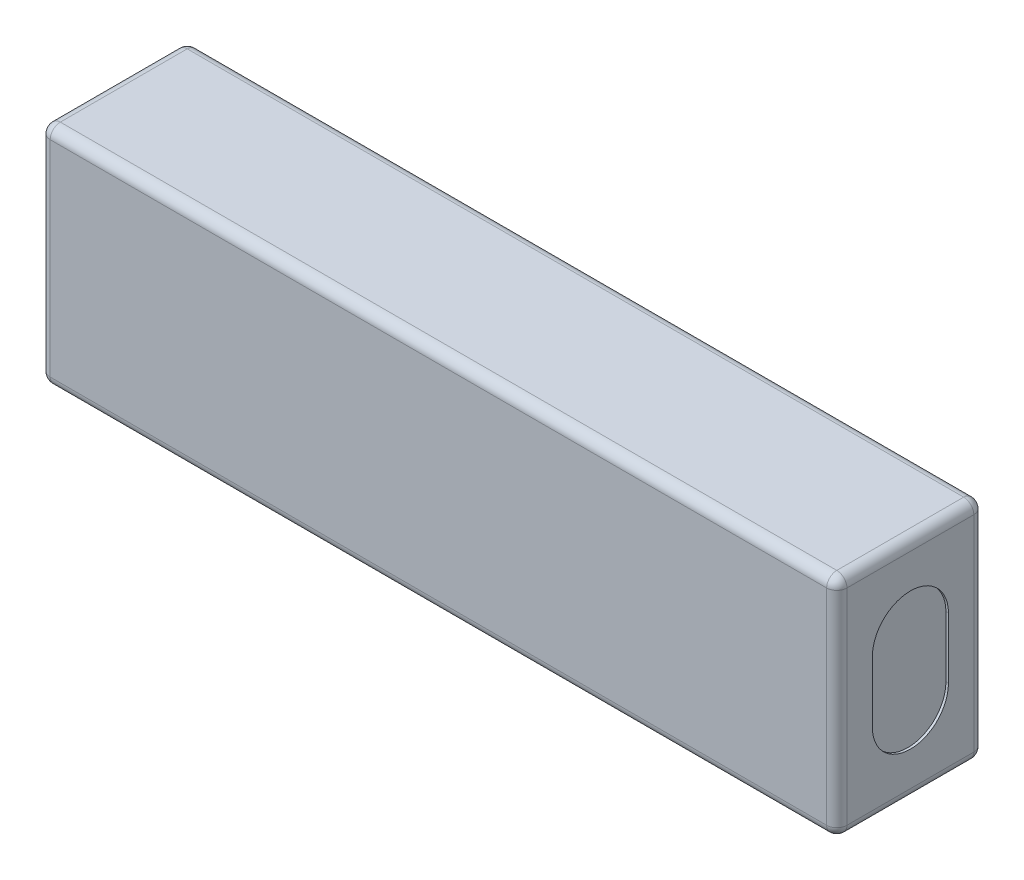
ISO-10303-21;
HEADER;
FILE_DESCRIPTION(('STEP AP214'),'2;1');
FILE_NAME('part.step','',(''),(''),'','','');
FILE_SCHEMA(('AUTOMOTIVE_DESIGN { 1 0 10303 214 1 1 1 1 }'));
ENDSEC;
DATA;
#1=APPLICATION_CONTEXT('core data for automotive mechanical design processes');
#2=APPLICATION_PROTOCOL_DEFINITION('international standard','automotive_design',2000,#1);
#3=PRODUCT_CONTEXT('',#1,'mechanical');
#4=PRODUCT('Part','Part','',(#3));
#5=PRODUCT_RELATED_PRODUCT_CATEGORY('part','',(#4));
#6=PRODUCT_DEFINITION_FORMATION('','',#4);
#7=PRODUCT_DEFINITION_CONTEXT('part definition',#1,'design');
#8=PRODUCT_DEFINITION('design','',#6,#7);
#9=PRODUCT_DEFINITION_SHAPE('','',#8);
#10=(LENGTH_UNIT() NAMED_UNIT(*) SI_UNIT(.MILLI.,.METRE.));
#11=(NAMED_UNIT(*) PLANE_ANGLE_UNIT() SI_UNIT($,.RADIAN.));
#12=(NAMED_UNIT(*) SI_UNIT($,.STERADIAN.) SOLID_ANGLE_UNIT());
#13=UNCERTAINTY_MEASURE_WITH_UNIT(LENGTH_MEASURE(1.E-05),#10,'distance_accuracy_value','');
#14=(GEOMETRIC_REPRESENTATION_CONTEXT(3) GLOBAL_UNCERTAINTY_ASSIGNED_CONTEXT((#13)) GLOBAL_UNIT_ASSIGNED_CONTEXT((#10,
#11,#12)) REPRESENTATION_CONTEXT('',''));
#15=CARTESIAN_POINT('',(0.,0.,0.));
#16=DIRECTION('',(0.,0.,1.));
#17=DIRECTION('',(1.,0.,0.));
#18=AXIS2_PLACEMENT_3D('',#15,#16,#17);
#19=CARTESIAN_POINT('',(-78.5,22.25,14.5));
#20=DIRECTION('',(1.,0.,0.));
#21=DIRECTION('',(0.,1.,0.));
#22=AXIS2_PLACEMENT_3D('',#19,#20,#21);
#23=PLANE('',#22);
#24=DIRECTION('',(0.,-1.,0.));
#25=VECTOR('',#24,1.);
#26=CARTESIAN_POINT('',(-78.5,22.25,-12.5));
#27=LINE('',#26,#25);
#28=CARTESIAN_POINT('',(-78.5,20.25,-12.5));
#29=VERTEX_POINT('',#28);
#30=CARTESIAN_POINT('',(-78.5,-20.25,-12.5));
#31=VERTEX_POINT('',#30);
#32=EDGE_CURVE('E260',#29,#31,#27,.T.);
#33=ORIENTED_EDGE('',*,*,#32,.T.);
#34=DIRECTION('',(0.,0.,-1.));
#35=VECTOR('',#34,1.);
#36=CARTESIAN_POINT('',(-78.5,-20.25,14.5));
#37=LINE('',#36,#35);
#38=CARTESIAN_POINT('',(-78.5,-20.25,12.5));
#39=VERTEX_POINT('',#38);
#40=EDGE_CURVE('E262',#31,#39,#37,.F.);
#41=ORIENTED_EDGE('',*,*,#40,.T.);
#42=DIRECTION('',(0.,-1.,0.));
#43=VECTOR('',#42,1.);
#44=CARTESIAN_POINT('',(-78.5,22.25,12.5));
#45=LINE('',#44,#43);
#46=CARTESIAN_POINT('',(-78.5,20.25,12.5));
#47=VERTEX_POINT('',#46);
#48=EDGE_CURVE('E256',#39,#47,#45,.F.);
#49=ORIENTED_EDGE('',*,*,#48,.T.);
#50=DIRECTION('',(0.,0.,-1.));
#51=VECTOR('',#50,1.);
#52=CARTESIAN_POINT('',(-78.5,20.25,14.5));
#53=LINE('',#52,#51);
#54=EDGE_CURVE('E258',#47,#29,#53,.T.);
#55=ORIENTED_EDGE('',*,*,#54,.T.);
#56=EDGE_LOOP('',(#33,#41,#49,#55));
#57=FACE_BOUND('',#56,.T.);
#58=CARTESIAN_POINT('',(-78.5,6.00000000000004,0.));
#59=DIRECTION('',(1.,0.,0.));
#60=DIRECTION('',(0.,1.,0.));
#61=AXIS2_PLACEMENT_3D('',#58,#59,#60);
#62=CIRCLE('',#61,7.5);
#63=CARTESIAN_POINT('',(-78.5,6.00000000000004,-7.5));
#64=VERTEX_POINT('',#63);
#65=CARTESIAN_POINT('',(-78.5,6.00000000000004,7.5));
#66=VERTEX_POINT('',#65);
#67=EDGE_CURVE('E193',#64,#66,#62,.T.);
#68=ORIENTED_EDGE('',*,*,#67,.T.);
#69=DIRECTION('',(0.,-1.,0.));
#70=VECTOR('',#69,1.);
#71=CARTESIAN_POINT('',(-78.5,6.00000000000004,7.5));
#72=LINE('',#71,#70);
#73=CARTESIAN_POINT('',(-78.5,-5.99999999999996,7.49999999999999));
#74=VERTEX_POINT('',#73);
#75=EDGE_CURVE('E197',#66,#74,#72,.T.);
#76=ORIENTED_EDGE('',*,*,#75,.T.);
#77=CARTESIAN_POINT('',(-78.5,-5.99999999999996,0.));
#78=DIRECTION('',(1.,0.,0.));
#79=DIRECTION('',(0.,1.,0.));
#80=AXIS2_PLACEMENT_3D('',#77,#78,#79);
#81=CIRCLE('',#80,7.5);
#82=CARTESIAN_POINT('',(-78.5,-5.99999999999996,-7.5));
#83=VERTEX_POINT('',#82);
#84=EDGE_CURVE('E200',#74,#83,#81,.T.);
#85=ORIENTED_EDGE('',*,*,#84,.T.);
#86=DIRECTION('',(0.,1.,0.));
#87=VECTOR('',#86,1.);
#88=CARTESIAN_POINT('',(-78.5,6.00000000000004,-7.5));
#89=LINE('',#88,#87);
#90=EDGE_CURVE('E206',#83,#64,#89,.T.);
#91=ORIENTED_EDGE('',*,*,#90,.T.);
#92=EDGE_LOOP('',(#68,#76,#85,#91));
#93=FACE_BOUND('',#92,.T.);
#94=ADVANCED_FACE('F36',(#57,#93),#23,.F.);
#95=CARTESIAN_POINT('',(78.5,22.25,14.5));
#96=DIRECTION('',(-1.,0.,0.));
#97=DIRECTION('',(0.,-1.,0.));
#98=AXIS2_PLACEMENT_3D('',#95,#96,#97);
#99=PLANE('',#98);
#100=DIRECTION('',(0.,1.,0.));
#101=VECTOR('',#100,1.);
#102=CARTESIAN_POINT('',(78.5,-22.25,12.5));
#103=LINE('',#102,#101);
#104=CARTESIAN_POINT('',(78.5,20.25,12.5));
#105=VERTEX_POINT('',#104);
#106=CARTESIAN_POINT('',(78.5,-20.25,12.5));
#107=VERTEX_POINT('',#106);
#108=EDGE_CURVE('E265',#105,#107,#103,.F.);
#109=ORIENTED_EDGE('',*,*,#108,.T.);
#110=DIRECTION('',(0.,0.,-1.));
#111=VECTOR('',#110,1.);
#112=CARTESIAN_POINT('',(78.5,-20.25,14.5));
#113=LINE('',#112,#111);
#114=CARTESIAN_POINT('',(78.5,-20.25,-12.5));
#115=VERTEX_POINT('',#114);
#116=EDGE_CURVE('E271',#107,#115,#113,.T.);
#117=ORIENTED_EDGE('',*,*,#116,.T.);
#118=DIRECTION('',(0.,1.,0.));
#119=VECTOR('',#118,1.);
#120=CARTESIAN_POINT('',(78.5,22.25,-12.5));
#121=LINE('',#120,#119);
#122=CARTESIAN_POINT('',(78.5,20.25,-12.5));
#123=VERTEX_POINT('',#122);
#124=EDGE_CURVE('E269',#115,#123,#121,.T.);
#125=ORIENTED_EDGE('',*,*,#124,.T.);
#126=DIRECTION('',(0.,0.,-1.));
#127=VECTOR('',#126,1.);
#128=CARTESIAN_POINT('',(78.5,20.25,14.5));
#129=LINE('',#128,#127);
#130=EDGE_CURVE('E267',#123,#105,#129,.F.);
#131=ORIENTED_EDGE('',*,*,#130,.T.);
#132=EDGE_LOOP('',(#109,#117,#125,#131));
#133=FACE_BOUND('',#132,.T.);
#134=DIRECTION('',(0.,-1.,0.));
#135=VECTOR('',#134,1.);
#136=CARTESIAN_POINT('',(78.5,6.00000000000004,7.5));
#137=LINE('',#136,#135);
#138=CARTESIAN_POINT('',(78.5,6.00000000000004,7.5));
#139=VERTEX_POINT('',#138);
#140=CARTESIAN_POINT('',(78.5,-5.99999999999996,7.49999999999999));
#141=VERTEX_POINT('',#140);
#142=EDGE_CURVE('E231',#139,#141,#137,.T.);
#143=ORIENTED_EDGE('',*,*,#142,.F.);
#144=CARTESIAN_POINT('',(78.5,6.00000000000004,0.));
#145=DIRECTION('',(1.,0.,0.));
#146=DIRECTION('',(0.,1.,0.));
#147=AXIS2_PLACEMENT_3D('',#144,#145,#146);
#148=CIRCLE('',#147,7.5);
#149=CARTESIAN_POINT('',(78.5,6.00000000000004,-7.5));
#150=VERTEX_POINT('',#149);
#151=EDGE_CURVE('E212',#150,#139,#148,.T.);
#152=ORIENTED_EDGE('',*,*,#151,.F.);
#153=DIRECTION('',(0.,1.,0.));
#154=VECTOR('',#153,1.);
#155=CARTESIAN_POINT('',(78.5,6.00000000000004,-7.5));
#156=LINE('',#155,#154);
#157=CARTESIAN_POINT('',(78.5,-5.99999999999996,-7.5));
#158=VERTEX_POINT('',#157);
#159=EDGE_CURVE('E220',#158,#150,#156,.T.);
#160=ORIENTED_EDGE('',*,*,#159,.F.);
#161=CARTESIAN_POINT('',(78.5,-5.99999999999996,0.));
#162=DIRECTION('',(1.,0.,0.));
#163=DIRECTION('',(0.,1.,0.));
#164=AXIS2_PLACEMENT_3D('',#161,#162,#163);
#165=CIRCLE('',#164,7.5);
#166=EDGE_CURVE('E234',#141,#158,#165,.T.);
#167=ORIENTED_EDGE('',*,*,#166,.F.);
#168=EDGE_LOOP('',(#143,#152,#160,#167));
#169=FACE_BOUND('',#168,.T.);
#170=ADVANCED_FACE('F399',(#133,#169),#99,.F.);
#171=CARTESIAN_POINT('',(-78.5,22.25,14.5));
#172=DIRECTION('',(0.,-1.,0.));
#173=DIRECTION('',(0.,0.,-1.));
#174=AXIS2_PLACEMENT_3D('',#171,#172,#173);
#175=PLANE('',#174);
#176=DIRECTION('',(0.,0.,-1.));
#177=VECTOR('',#176,1.);
#178=CARTESIAN_POINT('',(76.5,22.25,14.5));
#179=LINE('',#178,#177);
#180=CARTESIAN_POINT('',(76.5,22.25,12.5));
#181=VERTEX_POINT('',#180);
#182=CARTESIAN_POINT('',(76.5,22.25,-12.5));
#183=VERTEX_POINT('',#182);
#184=EDGE_CURVE('E287',#181,#183,#179,.T.);
#185=ORIENTED_EDGE('',*,*,#184,.T.);
#186=DIRECTION('',(-1.,0.,0.));
#187=VECTOR('',#186,1.);
#188=CARTESIAN_POINT('',(-78.5,22.25,-12.5));
#189=LINE('',#188,#187);
#190=CARTESIAN_POINT('',(-76.5,22.25,-12.5));
#191=VERTEX_POINT('',#190);
#192=EDGE_CURVE('E290',#183,#191,#189,.T.);
#193=ORIENTED_EDGE('',*,*,#192,.T.);
#194=DIRECTION('',(0.,0.,-1.));
#195=VECTOR('',#194,1.);
#196=CARTESIAN_POINT('',(-76.5,22.25,14.5));
#197=LINE('',#196,#195);
#198=CARTESIAN_POINT('',(-76.5,22.25,12.5));
#199=VERTEX_POINT('',#198);
#200=EDGE_CURVE('E285',#191,#199,#197,.F.);
#201=ORIENTED_EDGE('',*,*,#200,.T.);
#202=DIRECTION('',(-1.,0.,0.));
#203=VECTOR('',#202,1.);
#204=CARTESIAN_POINT('',(78.5,22.25,12.5));
#205=LINE('',#204,#203);
#206=EDGE_CURVE('E283',#199,#181,#205,.F.);
#207=ORIENTED_EDGE('',*,*,#206,.T.);
#208=EDGE_LOOP('',(#185,#193,#201,#207));
#209=FACE_BOUND('',#208,.T.);
#210=ADVANCED_FACE('F414',(#209),#175,.F.);
#211=CARTESIAN_POINT('',(-78.5,-22.25,14.5));
#212=DIRECTION('',(0.,1.,0.));
#213=DIRECTION('',(0.,0.,1.));
#214=AXIS2_PLACEMENT_3D('',#211,#212,#213);
#215=PLANE('',#214);
#216=DIRECTION('',(0.,0.,-1.));
#217=VECTOR('',#216,1.);
#218=CARTESIAN_POINT('',(-76.5,-22.25,14.5));
#219=LINE('',#218,#217);
#220=CARTESIAN_POINT('',(-76.5,-22.25,12.5));
#221=VERTEX_POINT('',#220);
#222=CARTESIAN_POINT('',(-76.5,-22.25,-12.5));
#223=VERTEX_POINT('',#222);
#224=EDGE_CURVE('E251',#221,#223,#219,.T.);
#225=ORIENTED_EDGE('',*,*,#224,.T.);
#226=DIRECTION('',(1.,0.,0.));
#227=VECTOR('',#226,1.);
#228=CARTESIAN_POINT('',(-78.5,-22.25,-12.5));
#229=LINE('',#228,#227);
#230=CARTESIAN_POINT('',(76.5,-22.25,-12.5));
#231=VERTEX_POINT('',#230);
#232=EDGE_CURVE('E254',#223,#231,#229,.T.);
#233=ORIENTED_EDGE('',*,*,#232,.T.);
#234=DIRECTION('',(0.,0.,-1.));
#235=VECTOR('',#234,1.);
#236=CARTESIAN_POINT('',(76.5,-22.25,14.5));
#237=LINE('',#236,#235);
#238=CARTESIAN_POINT('',(76.5,-22.25,12.5));
#239=VERTEX_POINT('',#238);
#240=EDGE_CURVE('E249',#231,#239,#237,.F.);
#241=ORIENTED_EDGE('',*,*,#240,.T.);
#242=DIRECTION('',(1.,0.,0.));
#243=VECTOR('',#242,1.);
#244=CARTESIAN_POINT('',(-78.5,-22.25,12.5));
#245=LINE('',#244,#243);
#246=EDGE_CURVE('E241',#239,#221,#245,.F.);
#247=ORIENTED_EDGE('',*,*,#246,.T.);
#248=EDGE_LOOP('',(#225,#233,#241,#247));
#249=FACE_BOUND('',#248,.T.);
#250=ADVANCED_FACE('F446',(#249),#215,.F.);
#251=CARTESIAN_POINT('',(0.,0.,14.5));
#252=DIRECTION('',(0.,0.,1.));
#253=DIRECTION('',(1.,0.,0.));
#254=AXIS2_PLACEMENT_3D('',#251,#252,#253);
#255=PLANE('',#254);
#256=DIRECTION('',(0.,-1.,0.));
#257=VECTOR('',#256,1.);
#258=CARTESIAN_POINT('',(-76.5,-22.25,14.5));
#259=LINE('',#258,#257);
#260=CARTESIAN_POINT('',(-76.5,20.25,14.5));
#261=VERTEX_POINT('',#260);
#262=CARTESIAN_POINT('',(-76.5,-20.25,14.5));
#263=VERTEX_POINT('',#262);
#264=EDGE_CURVE('E45',#261,#263,#259,.T.);
#265=ORIENTED_EDGE('',*,*,#264,.T.);
#266=DIRECTION('',(1.,0.,0.));
#267=VECTOR('',#266,1.);
#268=CARTESIAN_POINT('',(78.5,-20.25,14.5));
#269=LINE('',#268,#267);
#270=CARTESIAN_POINT('',(76.5,-20.25,14.5));
#271=VERTEX_POINT('',#270);
#272=EDGE_CURVE('E11',#263,#271,#269,.T.);
#273=ORIENTED_EDGE('',*,*,#272,.T.);
#274=DIRECTION('',(0.,1.,0.));
#275=VECTOR('',#274,1.);
#276=CARTESIAN_POINT('',(76.5,22.25,14.5));
#277=LINE('',#276,#275);
#278=CARTESIAN_POINT('',(76.5,20.25,14.5));
#279=VERTEX_POINT('',#278);
#280=EDGE_CURVE('E292',#271,#279,#277,.T.);
#281=ORIENTED_EDGE('',*,*,#280,.T.);
#282=DIRECTION('',(-1.,0.,0.));
#283=VECTOR('',#282,1.);
#284=CARTESIAN_POINT('',(-78.5,20.25,14.5));
#285=LINE('',#284,#283);
#286=EDGE_CURVE('E56',#279,#261,#285,.T.);
#287=ORIENTED_EDGE('',*,*,#286,.T.);
#288=EDGE_LOOP('',(#265,#273,#281,#287));
#289=FACE_BOUND('',#288,.T.);
#290=ADVANCED_FACE('F392',(#289),#255,.T.);
#291=CARTESIAN_POINT('',(0.,0.,-14.5));
#292=DIRECTION('',(0.,0.,1.));
#293=DIRECTION('',(1.,0.,0.));
#294=AXIS2_PLACEMENT_3D('',#291,#292,#293);
#295=PLANE('',#294);
#296=DIRECTION('',(1.,0.,0.));
#297=VECTOR('',#296,1.);
#298=CARTESIAN_POINT('',(0.,-20.25,-14.5));
#299=LINE('',#298,#297);
#300=CARTESIAN_POINT('',(76.5,-20.25,-14.5));
#301=VERTEX_POINT('',#300);
#302=CARTESIAN_POINT('',(-76.5,-20.25,-14.5));
#303=VERTEX_POINT('',#302);
#304=EDGE_CURVE('E278',#301,#303,#299,.F.);
#305=ORIENTED_EDGE('',*,*,#304,.T.);
#306=DIRECTION('',(0.,-1.,0.));
#307=VECTOR('',#306,1.);
#308=CARTESIAN_POINT('',(-76.5,0.,-14.5));
#309=LINE('',#308,#307);
#310=CARTESIAN_POINT('',(-76.5,20.25,-14.5));
#311=VERTEX_POINT('',#310);
#312=EDGE_CURVE('E280',#303,#311,#309,.F.);
#313=ORIENTED_EDGE('',*,*,#312,.T.);
#314=DIRECTION('',(-1.,0.,0.));
#315=VECTOR('',#314,1.);
#316=CARTESIAN_POINT('',(0.,20.25,-14.5));
#317=LINE('',#316,#315);
#318=CARTESIAN_POINT('',(76.5,20.25,-14.5));
#319=VERTEX_POINT('',#318);
#320=EDGE_CURVE('E274',#311,#319,#317,.F.);
#321=ORIENTED_EDGE('',*,*,#320,.T.);
#322=DIRECTION('',(0.,1.,0.));
#323=VECTOR('',#322,1.);
#324=CARTESIAN_POINT('',(76.5,0.,-14.5));
#325=LINE('',#324,#323);
#326=EDGE_CURVE('E276',#319,#301,#325,.F.);
#327=ORIENTED_EDGE('',*,*,#326,.T.);
#328=EDGE_LOOP('',(#305,#313,#321,#327));
#329=FACE_BOUND('',#328,.T.);
#330=ADVANCED_FACE('F453',(#329),#295,.F.);
#331=CARTESIAN_POINT('',(78.,6.00000000000004,0.));
#332=DIRECTION('',(1.,0.,0.));
#333=DIRECTION('',(0.,1.,0.));
#334=AXIS2_PLACEMENT_3D('',#331,#332,#333);
#335=CYLINDRICAL_SURFACE('',#334,7.5);
#336=ORIENTED_EDGE('',*,*,#151,.T.);
#337=DIRECTION('',(1.,0.,0.));
#338=VECTOR('',#337,1.);
#339=CARTESIAN_POINT('',(78.,6.00000000000004,7.5));
#340=LINE('',#339,#338);
#341=CARTESIAN_POINT('',(78.,6.00000000000004,7.5));
#342=VERTEX_POINT('',#341);
#343=EDGE_CURVE('E229',#342,#139,#340,.T.);
#344=ORIENTED_EDGE('',*,*,#343,.F.);
#345=CARTESIAN_POINT('',(78.,6.00000000000004,0.));
#346=DIRECTION('',(1.,0.,0.));
#347=DIRECTION('',(0.,1.,0.));
#348=AXIS2_PLACEMENT_3D('',#345,#346,#347);
#349=CIRCLE('',#348,7.5);
#350=CARTESIAN_POINT('',(78.,6.00000000000004,-7.5));
#351=VERTEX_POINT('',#350);
#352=EDGE_CURVE('E216',#351,#342,#349,.T.);
#353=ORIENTED_EDGE('',*,*,#352,.F.);
#354=DIRECTION('',(1.,0.,0.));
#355=VECTOR('',#354,1.);
#356=CARTESIAN_POINT('',(78.,6.00000000000004,-7.5));
#357=LINE('',#356,#355);
#358=EDGE_CURVE('E239',#351,#150,#357,.T.);
#359=ORIENTED_EDGE('',*,*,#358,.T.);
#360=EDGE_LOOP('',(#336,#344,#353,#359));
#361=FACE_BOUND('',#360,.T.);
#362=ADVANCED_FACE('F535',(#361),#335,.F.);
#363=CARTESIAN_POINT('',(78.,6.00000000000004,-7.5));
#364=DIRECTION('',(0.,0.,-1.));
#365=DIRECTION('',(-1.,0.,0.));
#366=AXIS2_PLACEMENT_3D('',#363,#364,#365);
#367=PLANE('',#366);
#368=ORIENTED_EDGE('',*,*,#159,.T.);
#369=ORIENTED_EDGE('',*,*,#358,.F.);
#370=DIRECTION('',(0.,1.,0.));
#371=VECTOR('',#370,1.);
#372=CARTESIAN_POINT('',(78.,6.00000000000004,-7.5));
#373=LINE('',#372,#371);
#374=CARTESIAN_POINT('',(78.,-5.99999999999996,-7.5));
#375=VERTEX_POINT('',#374);
#376=EDGE_CURVE('E226',#375,#351,#373,.T.);
#377=ORIENTED_EDGE('',*,*,#376,.F.);
#378=DIRECTION('',(1.,0.,0.));
#379=VECTOR('',#378,1.);
#380=CARTESIAN_POINT('',(78.,-5.99999999999996,-7.5));
#381=LINE('',#380,#379);
#382=EDGE_CURVE('E242',#375,#158,#381,.T.);
#383=ORIENTED_EDGE('',*,*,#382,.T.);
#384=EDGE_LOOP('',(#368,#369,#377,#383));
#385=FACE_BOUND('',#384,.T.);
#386=ADVANCED_FACE('F531',(#385),#367,.F.);
#387=CARTESIAN_POINT('',(78.,-5.99999999999996,0.));
#388=DIRECTION('',(1.,0.,0.));
#389=DIRECTION('',(0.,1.,0.));
#390=AXIS2_PLACEMENT_3D('',#387,#388,#389);
#391=CYLINDRICAL_SURFACE('',#390,7.5);
#392=ORIENTED_EDGE('',*,*,#166,.T.);
#393=ORIENTED_EDGE('',*,*,#382,.F.);
#394=CARTESIAN_POINT('',(78.,-5.99999999999996,0.));
#395=DIRECTION('',(1.,0.,0.));
#396=DIRECTION('',(0.,1.,0.));
#397=AXIS2_PLACEMENT_3D('',#394,#395,#396);
#398=CIRCLE('',#397,7.5);
#399=CARTESIAN_POINT('',(78.,-5.99999999999996,7.49999999999999));
#400=VERTEX_POINT('',#399);
#401=EDGE_CURVE('E223',#400,#375,#398,.T.);
#402=ORIENTED_EDGE('',*,*,#401,.F.);
#403=DIRECTION('',(1.,0.,0.));
#404=VECTOR('',#403,1.);
#405=CARTESIAN_POINT('',(78.,-5.99999999999996,7.49999999999999));
#406=LINE('',#405,#404);
#407=EDGE_CURVE('E244',#400,#141,#406,.T.);
#408=ORIENTED_EDGE('',*,*,#407,.T.);
#409=EDGE_LOOP('',(#392,#393,#402,#408));
#410=FACE_BOUND('',#409,.T.);
#411=ADVANCED_FACE('F534',(#410),#391,.F.);
#412=CARTESIAN_POINT('',(78.,6.00000000000004,7.5));
#413=DIRECTION('',(0.,0.,1.));
#414=DIRECTION('',(0.,-1.,0.));
#415=AXIS2_PLACEMENT_3D('',#412,#413,#414);
#416=PLANE('',#415);
#417=ORIENTED_EDGE('',*,*,#142,.T.);
#418=ORIENTED_EDGE('',*,*,#407,.F.);
#419=DIRECTION('',(0.,-1.,0.));
#420=VECTOR('',#419,1.);
#421=CARTESIAN_POINT('',(78.,6.00000000000004,7.5));
#422=LINE('',#421,#420);
#423=EDGE_CURVE('E219',#342,#400,#422,.T.);
#424=ORIENTED_EDGE('',*,*,#423,.F.);
#425=ORIENTED_EDGE('',*,*,#343,.T.);
#426=EDGE_LOOP('',(#417,#418,#424,#425));
#427=FACE_BOUND('',#426,.T.);
#428=ADVANCED_FACE('F529',(#427),#416,.F.);
#429=CARTESIAN_POINT('',(78.,6.00000000000004,0.));
#430=DIRECTION('',(1.,0.,0.));
#431=DIRECTION('',(0.,1.,0.));
#432=AXIS2_PLACEMENT_3D('',#429,#430,#431);
#433=PLANE('',#432);
#434=ORIENTED_EDGE('',*,*,#352,.T.);
#435=ORIENTED_EDGE('',*,*,#423,.T.);
#436=ORIENTED_EDGE('',*,*,#401,.T.);
#437=ORIENTED_EDGE('',*,*,#376,.T.);
#438=EDGE_LOOP('',(#434,#435,#436,#437));
#439=FACE_BOUND('',#438,.T.);
#440=ADVANCED_FACE('F526',(#439),#433,.T.);
#441=CARTESIAN_POINT('',(-78.,6.00000000000004,0.));
#442=DIRECTION('',(-1.,0.,0.));
#443=DIRECTION('',(0.,-1.,0.));
#444=AXIS2_PLACEMENT_3D('',#441,#442,#443);
#445=CYLINDRICAL_SURFACE('',#444,7.5);
#446=ORIENTED_EDGE('',*,*,#67,.F.);
#447=DIRECTION('',(-1.,0.,0.));
#448=VECTOR('',#447,1.);
#449=CARTESIAN_POINT('',(-78.,6.00000000000004,-7.5));
#450=LINE('',#449,#448);
#451=CARTESIAN_POINT('',(-78.,6.00000000000004,-7.5));
#452=VERTEX_POINT('',#451);
#453=EDGE_CURVE('E178',#452,#64,#450,.T.);
#454=ORIENTED_EDGE('',*,*,#453,.F.);
#455=CARTESIAN_POINT('',(-78.,6.00000000000004,0.));
#456=DIRECTION('',(1.,0.,0.));
#457=DIRECTION('',(0.,1.,0.));
#458=AXIS2_PLACEMENT_3D('',#455,#456,#457);
#459=CIRCLE('',#458,7.5);
#460=CARTESIAN_POINT('',(-78.,6.00000000000004,7.5));
#461=VERTEX_POINT('',#460);
#462=EDGE_CURVE('E185',#452,#461,#459,.T.);
#463=ORIENTED_EDGE('',*,*,#462,.T.);
#464=DIRECTION('',(-1.,0.,0.));
#465=VECTOR('',#464,1.);
#466=CARTESIAN_POINT('',(-78.,6.00000000000004,7.5));
#467=LINE('',#466,#465);
#468=EDGE_CURVE('E210',#461,#66,#467,.T.);
#469=ORIENTED_EDGE('',*,*,#468,.T.);
#470=EDGE_LOOP('',(#446,#454,#463,#469));
#471=FACE_BOUND('',#470,.T.);
#472=ADVANCED_FACE('F189',(#471),#445,.F.);
#473=CARTESIAN_POINT('',(-78.,6.00000000000004,7.5));
#474=DIRECTION('',(0.,0.,-1.));
#475=DIRECTION('',(0.,1.,0.));
#476=AXIS2_PLACEMENT_3D('',#473,#474,#475);
#477=PLANE('',#476);
#478=ORIENTED_EDGE('',*,*,#75,.F.);
#479=ORIENTED_EDGE('',*,*,#468,.F.);
#480=DIRECTION('',(0.,-1.,0.));
#481=VECTOR('',#480,1.);
#482=CARTESIAN_POINT('',(-78.,6.00000000000004,7.5));
#483=LINE('',#482,#481);
#484=CARTESIAN_POINT('',(-78.,-5.99999999999996,7.49999999999999));
#485=VERTEX_POINT('',#484);
#486=EDGE_CURVE('E194',#461,#485,#483,.T.);
#487=ORIENTED_EDGE('',*,*,#486,.T.);
#488=DIRECTION('',(-1.,0.,0.));
#489=VECTOR('',#488,1.);
#490=CARTESIAN_POINT('',(-78.,-5.99999999999996,7.49999999999999));
#491=LINE('',#490,#489);
#492=EDGE_CURVE('E213',#485,#74,#491,.T.);
#493=ORIENTED_EDGE('',*,*,#492,.T.);
#494=EDGE_LOOP('',(#478,#479,#487,#493));
#495=FACE_BOUND('',#494,.T.);
#496=ADVANCED_FACE('F517',(#495),#477,.T.);
#497=CARTESIAN_POINT('',(-78.,-5.99999999999996,0.));
#498=DIRECTION('',(-1.,0.,0.));
#499=DIRECTION('',(0.,-1.,0.));
#500=AXIS2_PLACEMENT_3D('',#497,#498,#499);
#501=CYLINDRICAL_SURFACE('',#500,7.5);
#502=ORIENTED_EDGE('',*,*,#84,.F.);
#503=ORIENTED_EDGE('',*,*,#492,.F.);
#504=CARTESIAN_POINT('',(-78.,-5.99999999999996,0.));
#505=DIRECTION('',(1.,0.,0.));
#506=DIRECTION('',(0.,1.,0.));
#507=AXIS2_PLACEMENT_3D('',#504,#505,#506);
#508=CIRCLE('',#507,7.5);
#509=CARTESIAN_POINT('',(-78.,-5.99999999999996,-7.5));
#510=VERTEX_POINT('',#509);
#511=EDGE_CURVE('E184',#485,#510,#508,.T.);
#512=ORIENTED_EDGE('',*,*,#511,.T.);
#513=DIRECTION('',(-1.,0.,0.));
#514=VECTOR('',#513,1.);
#515=CARTESIAN_POINT('',(-78.,-5.99999999999996,-7.5));
#516=LINE('',#515,#514);
#517=EDGE_CURVE('E180',#510,#83,#516,.T.);
#518=ORIENTED_EDGE('',*,*,#517,.T.);
#519=EDGE_LOOP('',(#502,#503,#512,#518));
#520=FACE_BOUND('',#519,.T.);
#521=ADVANCED_FACE('F514',(#520),#501,.F.);
#522=CARTESIAN_POINT('',(-78.,6.00000000000004,-7.5));
#523=DIRECTION('',(0.,0.,1.));
#524=DIRECTION('',(1.,0.,0.));
#525=AXIS2_PLACEMENT_3D('',#522,#523,#524);
#526=PLANE('',#525);
#527=ORIENTED_EDGE('',*,*,#90,.F.);
#528=ORIENTED_EDGE('',*,*,#517,.F.);
#529=DIRECTION('',(0.,1.,0.));
#530=VECTOR('',#529,1.);
#531=CARTESIAN_POINT('',(-78.,6.00000000000004,-7.5));
#532=LINE('',#531,#530);
#533=EDGE_CURVE('E174',#510,#452,#532,.T.);
#534=ORIENTED_EDGE('',*,*,#533,.T.);
#535=ORIENTED_EDGE('',*,*,#453,.T.);
#536=EDGE_LOOP('',(#527,#528,#534,#535));
#537=FACE_BOUND('',#536,.T.);
#538=ADVANCED_FACE('F177',(#537),#526,.T.);
#539=CARTESIAN_POINT('',(-78.,6.00000000000004,0.));
#540=DIRECTION('',(-1.,0.,0.));
#541=DIRECTION('',(0.,1.,0.));
#542=AXIS2_PLACEMENT_3D('',#539,#540,#541);
#543=PLANE('',#542);
#544=ORIENTED_EDGE('',*,*,#462,.F.);
#545=ORIENTED_EDGE('',*,*,#533,.F.);
#546=ORIENTED_EDGE('',*,*,#511,.F.);
#547=ORIENTED_EDGE('',*,*,#486,.F.);
#548=EDGE_LOOP('',(#544,#545,#546,#547));
#549=FACE_BOUND('',#548,.T.);
#550=ADVANCED_FACE('F196',(#549),#543,.T.);
#551=CARTESIAN_POINT('',(76.5,20.25,14.5));
#552=DIRECTION('',(0.,0.,-1.));
#553=DIRECTION('',(-1.,0.,0.));
#554=AXIS2_PLACEMENT_3D('',#551,#552,#553);
#555=CYLINDRICAL_SURFACE('',#554,2.);
#556=CARTESIAN_POINT('',(76.5,20.25,12.5));
#557=DIRECTION('',(0.,0.,1.));
#558=DIRECTION('',(1.,0.,0.));
#559=AXIS2_PLACEMENT_3D('',#556,#557,#558);
#560=CIRCLE('',#559,2.);
#561=EDGE_CURVE('E40',#105,#181,#560,.T.);
#562=ORIENTED_EDGE('',*,*,#561,.F.);
#563=ORIENTED_EDGE('',*,*,#130,.F.);
#564=CARTESIAN_POINT('',(76.5,20.25,-12.5));
#565=DIRECTION('',(0.,0.,-1.));
#566=DIRECTION('',(-1.,0.,0.));
#567=AXIS2_PLACEMENT_3D('',#564,#565,#566);
#568=CIRCLE('',#567,2.);
#569=EDGE_CURVE('E356',#183,#123,#568,.T.);
#570=ORIENTED_EDGE('',*,*,#569,.F.);
#571=ORIENTED_EDGE('',*,*,#184,.F.);
#572=EDGE_LOOP('',(#562,#563,#570,#571));
#573=FACE_BOUND('',#572,.T.);
#574=ADVANCED_FACE('F38',(#573),#555,.T.);
#575=CARTESIAN_POINT('',(76.5,20.25,12.5));
#576=DIRECTION('',(0.,0.,1.));
#577=DIRECTION('',(1.,0.,0.));
#578=AXIS2_PLACEMENT_3D('',#575,#576,#577);
#579=SPHERICAL_SURFACE('',#578,2.);
#580=CARTESIAN_POINT('',(76.5,20.25,12.5));
#581=DIRECTION('',(0.,1.,0.));
#582=DIRECTION('',(0.,0.,1.));
#583=AXIS2_PLACEMENT_3D('',#580,#581,#582);
#584=CIRCLE('',#583,2.);
#585=EDGE_CURVE('E351',#105,#279,#584,.F.);
#586=ORIENTED_EDGE('',*,*,#585,.F.);
#587=ORIENTED_EDGE('',*,*,#561,.T.);
#588=CARTESIAN_POINT('',(76.5,20.25,12.5));
#589=DIRECTION('',(1.,0.,0.));
#590=DIRECTION('',(0.,0.,-1.));
#591=AXIS2_PLACEMENT_3D('',#588,#589,#590);
#592=CIRCLE('',#591,2.);
#593=EDGE_CURVE('E354',#279,#181,#592,.F.);
#594=ORIENTED_EDGE('',*,*,#593,.F.);
#595=EDGE_LOOP('',(#586,#587,#594));
#596=FACE_BOUND('',#595,.T.);
#597=ADVANCED_FACE('F367',(#596),#579,.T.);
#598=CARTESIAN_POINT('',(76.5,20.25,-12.5));
#599=DIRECTION('',(0.,0.,1.));
#600=DIRECTION('',(1.,0.,0.));
#601=AXIS2_PLACEMENT_3D('',#598,#599,#600);
#602=SPHERICAL_SURFACE('',#601,2.);
#603=CARTESIAN_POINT('',(76.5,20.25,-12.5));
#604=DIRECTION('',(1.,0.,0.));
#605=DIRECTION('',(0.,1.,0.));
#606=AXIS2_PLACEMENT_3D('',#603,#604,#605);
#607=CIRCLE('',#606,2.);
#608=EDGE_CURVE('E345',#183,#319,#607,.F.);
#609=ORIENTED_EDGE('',*,*,#608,.F.);
#610=ORIENTED_EDGE('',*,*,#569,.T.);
#611=CARTESIAN_POINT('',(76.5,20.25,-12.5));
#612=DIRECTION('',(0.,1.,0.));
#613=DIRECTION('',(0.,0.,1.));
#614=AXIS2_PLACEMENT_3D('',#611,#612,#613);
#615=CIRCLE('',#614,2.);
#616=EDGE_CURVE('E348',#319,#123,#615,.F.);
#617=ORIENTED_EDGE('',*,*,#616,.F.);
#618=EDGE_LOOP('',(#609,#610,#617));
#619=FACE_BOUND('',#618,.T.);
#620=ADVANCED_FACE('F501',(#619),#602,.T.);
#621=CARTESIAN_POINT('',(0.,20.25,12.5));
#622=DIRECTION('',(1.,0.,0.));
#623=DIRECTION('',(0.,0.,-1.));
#624=AXIS2_PLACEMENT_3D('',#621,#622,#623);
#625=CYLINDRICAL_SURFACE('',#624,2.);
#626=ORIENTED_EDGE('',*,*,#593,.T.);
#627=ORIENTED_EDGE('',*,*,#206,.F.);
#628=CARTESIAN_POINT('',(-76.5,20.25,12.5));
#629=DIRECTION('',(-1.,0.,0.));
#630=DIRECTION('',(0.,0.,1.));
#631=AXIS2_PLACEMENT_3D('',#628,#629,#630);
#632=CIRCLE('',#631,2.);
#633=EDGE_CURVE('E339',#261,#199,#632,.T.);
#634=ORIENTED_EDGE('',*,*,#633,.F.);
#635=ORIENTED_EDGE('',*,*,#286,.F.);
#636=EDGE_LOOP('',(#626,#627,#634,#635));
#637=FACE_BOUND('',#636,.T.);
#638=ADVANCED_FACE('F374',(#637),#625,.T.);
#639=CARTESIAN_POINT('',(76.5,0.,12.5));
#640=DIRECTION('',(0.,-1.,0.));
#641=DIRECTION('',(1.,0.,0.));
#642=AXIS2_PLACEMENT_3D('',#639,#640,#641);
#643=CYLINDRICAL_SURFACE('',#642,2.);
#644=ORIENTED_EDGE('',*,*,#585,.T.);
#645=ORIENTED_EDGE('',*,*,#280,.F.);
#646=CARTESIAN_POINT('',(76.5,-20.25,12.5));
#647=DIRECTION('',(0.,-1.,0.));
#648=DIRECTION('',(0.,0.,-1.));
#649=AXIS2_PLACEMENT_3D('',#646,#647,#648);
#650=CIRCLE('',#649,2.);
#651=EDGE_CURVE('E336',#107,#271,#650,.T.);
#652=ORIENTED_EDGE('',*,*,#651,.F.);
#653=ORIENTED_EDGE('',*,*,#108,.F.);
#654=EDGE_LOOP('',(#644,#645,#652,#653));
#655=FACE_BOUND('',#654,.T.);
#656=ADVANCED_FACE('F396',(#655),#643,.T.);
#657=CARTESIAN_POINT('',(76.5,-20.25,14.5));
#658=DIRECTION('',(0.,0.,-1.));
#659=DIRECTION('',(-1.,0.,0.));
#660=AXIS2_PLACEMENT_3D('',#657,#658,#659);
#661=CYLINDRICAL_SURFACE('',#660,2.);
#662=CARTESIAN_POINT('',(76.5,-20.25,-12.5));
#663=DIRECTION('',(0.,0.,-1.));
#664=DIRECTION('',(-1.,0.,0.));
#665=AXIS2_PLACEMENT_3D('',#662,#663,#664);
#666=CIRCLE('',#665,2.);
#667=EDGE_CURVE('E330',#115,#231,#666,.T.);
#668=ORIENTED_EDGE('',*,*,#667,.F.);
#669=ORIENTED_EDGE('',*,*,#116,.F.);
#670=CARTESIAN_POINT('',(76.5,-20.25,12.5));
#671=DIRECTION('',(0.,0.,1.));
#672=DIRECTION('',(1.,0.,0.));
#673=AXIS2_PLACEMENT_3D('',#670,#671,#672);
#674=CIRCLE('',#673,2.);
#675=EDGE_CURVE('E333',#239,#107,#674,.T.);
#676=ORIENTED_EDGE('',*,*,#675,.F.);
#677=ORIENTED_EDGE('',*,*,#240,.F.);
#678=EDGE_LOOP('',(#668,#669,#676,#677));
#679=FACE_BOUND('',#678,.T.);
#680=ADVANCED_FACE('F404',(#679),#661,.T.);
#681=CARTESIAN_POINT('',(76.5,22.25,-12.5));
#682=DIRECTION('',(0.,1.,0.));
#683=DIRECTION('',(-1.,0.,0.));
#684=AXIS2_PLACEMENT_3D('',#681,#682,#683);
#685=CYLINDRICAL_SURFACE('',#684,2.);
#686=ORIENTED_EDGE('',*,*,#616,.T.);
#687=ORIENTED_EDGE('',*,*,#124,.F.);
#688=CARTESIAN_POINT('',(76.5,-20.25,-12.5));
#689=DIRECTION('',(0.,-1.,0.));
#690=DIRECTION('',(1.,0.,0.));
#691=AXIS2_PLACEMENT_3D('',#688,#689,#690);
#692=CIRCLE('',#691,2.);
#693=EDGE_CURVE('E328',#301,#115,#692,.T.);
#694=ORIENTED_EDGE('',*,*,#693,.F.);
#695=ORIENTED_EDGE('',*,*,#326,.F.);
#696=EDGE_LOOP('',(#686,#687,#694,#695));
#697=FACE_BOUND('',#696,.T.);
#698=ADVANCED_FACE('F411',(#697),#685,.T.);
#699=CARTESIAN_POINT('',(-78.5,20.25,-12.5));
#700=DIRECTION('',(-1.,0.,0.));
#701=DIRECTION('',(0.,0.,1.));
#702=AXIS2_PLACEMENT_3D('',#699,#700,#701);
#703=CYLINDRICAL_SURFACE('',#702,2.);
#704=ORIENTED_EDGE('',*,*,#608,.T.);
#705=ORIENTED_EDGE('',*,*,#320,.F.);
#706=CARTESIAN_POINT('',(-76.5,20.25,-12.5));
#707=DIRECTION('',(-1.,0.,0.));
#708=DIRECTION('',(0.,0.,1.));
#709=AXIS2_PLACEMENT_3D('',#706,#707,#708);
#710=CIRCLE('',#709,2.);
#711=EDGE_CURVE('E325',#191,#311,#710,.T.);
#712=ORIENTED_EDGE('',*,*,#711,.F.);
#713=ORIENTED_EDGE('',*,*,#192,.F.);
#714=EDGE_LOOP('',(#704,#705,#712,#713));
#715=FACE_BOUND('',#714,.T.);
#716=ADVANCED_FACE('F424',(#715),#703,.T.);
#717=CARTESIAN_POINT('',(-76.5,20.25,14.5));
#718=DIRECTION('',(0.,0.,-1.));
#719=DIRECTION('',(-1.,0.,0.));
#720=AXIS2_PLACEMENT_3D('',#717,#718,#719);
#721=CYLINDRICAL_SURFACE('',#720,2.);
#722=CARTESIAN_POINT('',(-76.5,20.25,12.5));
#723=DIRECTION('',(0.,0.,1.));
#724=DIRECTION('',(1.,0.,0.));
#725=AXIS2_PLACEMENT_3D('',#722,#723,#724);
#726=CIRCLE('',#725,2.);
#727=EDGE_CURVE('E342',#199,#47,#726,.T.);
#728=ORIENTED_EDGE('',*,*,#727,.F.);
#729=ORIENTED_EDGE('',*,*,#200,.F.);
#730=CARTESIAN_POINT('',(-76.5,20.25,-12.5));
#731=DIRECTION('',(0.,0.,-1.));
#732=DIRECTION('',(-1.,0.,0.));
#733=AXIS2_PLACEMENT_3D('',#730,#731,#732);
#734=CIRCLE('',#733,2.);
#735=EDGE_CURVE('E322',#29,#191,#734,.T.);
#736=ORIENTED_EDGE('',*,*,#735,.F.);
#737=ORIENTED_EDGE('',*,*,#54,.F.);
#738=EDGE_LOOP('',(#728,#729,#736,#737));
#739=FACE_BOUND('',#738,.T.);
#740=ADVANCED_FACE('F419',(#739),#721,.T.);
#741=CARTESIAN_POINT('',(-76.5,20.25,12.5));
#742=DIRECTION('',(0.,0.,1.));
#743=DIRECTION('',(1.,0.,0.));
#744=AXIS2_PLACEMENT_3D('',#741,#742,#743);
#745=SPHERICAL_SURFACE('',#744,2.);
#746=ORIENTED_EDGE('',*,*,#633,.T.);
#747=ORIENTED_EDGE('',*,*,#727,.T.);
#748=CARTESIAN_POINT('',(-76.5,20.25,12.5));
#749=DIRECTION('',(0.,1.,0.));
#750=DIRECTION('',(0.,0.,1.));
#751=AXIS2_PLACEMENT_3D('',#748,#749,#750);
#752=CIRCLE('',#751,2.);
#753=EDGE_CURVE('E319',#261,#47,#752,.F.);
#754=ORIENTED_EDGE('',*,*,#753,.F.);
#755=EDGE_LOOP('',(#746,#747,#754));
#756=FACE_BOUND('',#755,.T.);
#757=ADVANCED_FACE('F378',(#756),#745,.T.);
#758=CARTESIAN_POINT('',(76.5,-20.25,12.5));
#759=DIRECTION('',(0.,0.,1.));
#760=DIRECTION('',(1.,0.,0.));
#761=AXIS2_PLACEMENT_3D('',#758,#759,#760);
#762=SPHERICAL_SURFACE('',#761,2.);
#763=ORIENTED_EDGE('',*,*,#675,.T.);
#764=ORIENTED_EDGE('',*,*,#651,.T.);
#765=CARTESIAN_POINT('',(76.5,-20.25,12.5));
#766=DIRECTION('',(1.,0.,0.));
#767=DIRECTION('',(0.,0.,-1.));
#768=AXIS2_PLACEMENT_3D('',#765,#766,#767);
#769=CIRCLE('',#768,2.);
#770=EDGE_CURVE('E317',#239,#271,#769,.F.);
#771=ORIENTED_EDGE('',*,*,#770,.F.);
#772=EDGE_LOOP('',(#763,#764,#771));
#773=FACE_BOUND('',#772,.T.);
#774=ADVANCED_FACE('F483',(#773),#762,.T.);
#775=CARTESIAN_POINT('',(76.5,-20.25,-12.5));
#776=DIRECTION('',(0.,0.,1.));
#777=DIRECTION('',(1.,0.,0.));
#778=AXIS2_PLACEMENT_3D('',#775,#776,#777);
#779=SPHERICAL_SURFACE('',#778,2.);
#780=ORIENTED_EDGE('',*,*,#693,.T.);
#781=ORIENTED_EDGE('',*,*,#667,.T.);
#782=CARTESIAN_POINT('',(76.5,-20.25,-12.5));
#783=DIRECTION('',(1.,0.,0.));
#784=DIRECTION('',(0.,0.,-1.));
#785=AXIS2_PLACEMENT_3D('',#782,#783,#784);
#786=CIRCLE('',#785,2.);
#787=EDGE_CURVE('E314',#301,#231,#786,.F.);
#788=ORIENTED_EDGE('',*,*,#787,.F.);
#789=EDGE_LOOP('',(#780,#781,#788));
#790=FACE_BOUND('',#789,.T.);
#791=ADVANCED_FACE('F480',(#790),#779,.T.);
#792=CARTESIAN_POINT('',(-76.5,20.25,-12.5));
#793=DIRECTION('',(0.,0.,1.));
#794=DIRECTION('',(1.,0.,0.));
#795=AXIS2_PLACEMENT_3D('',#792,#793,#794);
#796=SPHERICAL_SURFACE('',#795,2.);
#797=ORIENTED_EDGE('',*,*,#735,.T.);
#798=ORIENTED_EDGE('',*,*,#711,.T.);
#799=CARTESIAN_POINT('',(-76.5,20.25,-12.5));
#800=DIRECTION('',(0.,1.,0.));
#801=DIRECTION('',(0.,0.,1.));
#802=AXIS2_PLACEMENT_3D('',#799,#800,#801);
#803=CIRCLE('',#802,2.);
#804=EDGE_CURVE('E312',#29,#311,#803,.F.);
#805=ORIENTED_EDGE('',*,*,#804,.F.);
#806=EDGE_LOOP('',(#797,#798,#805));
#807=FACE_BOUND('',#806,.T.);
#808=ADVANCED_FACE('F426',(#807),#796,.T.);
#809=CARTESIAN_POINT('',(-76.5,0.,12.5));
#810=DIRECTION('',(0.,1.,0.));
#811=DIRECTION('',(-1.,0.,0.));
#812=AXIS2_PLACEMENT_3D('',#809,#810,#811);
#813=CYLINDRICAL_SURFACE('',#812,2.);
#814=ORIENTED_EDGE('',*,*,#753,.T.);
#815=ORIENTED_EDGE('',*,*,#48,.F.);
#816=CARTESIAN_POINT('',(-76.5,-20.25,12.5));
#817=DIRECTION('',(0.,-1.,0.));
#818=DIRECTION('',(0.,0.,-1.));
#819=AXIS2_PLACEMENT_3D('',#816,#817,#818);
#820=CIRCLE('',#819,2.);
#821=EDGE_CURVE('E309',#263,#39,#820,.T.);
#822=ORIENTED_EDGE('',*,*,#821,.F.);
#823=ORIENTED_EDGE('',*,*,#264,.F.);
#824=EDGE_LOOP('',(#814,#815,#822,#823));
#825=FACE_BOUND('',#824,.T.);
#826=ADVANCED_FACE('F382',(#825),#813,.T.);
#827=CARTESIAN_POINT('',(0.,-20.25,12.5));
#828=DIRECTION('',(-1.,0.,0.));
#829=DIRECTION('',(0.,0.,1.));
#830=AXIS2_PLACEMENT_3D('',#827,#828,#829);
#831=CYLINDRICAL_SURFACE('',#830,2.);
#832=ORIENTED_EDGE('',*,*,#770,.T.);
#833=ORIENTED_EDGE('',*,*,#272,.F.);
#834=CARTESIAN_POINT('',(-76.5,-20.25,12.5));
#835=DIRECTION('',(-1.,0.,0.));
#836=DIRECTION('',(0.,0.,1.));
#837=AXIS2_PLACEMENT_3D('',#834,#835,#836);
#838=CIRCLE('',#837,2.);
#839=EDGE_CURVE('E306',#221,#263,#838,.T.);
#840=ORIENTED_EDGE('',*,*,#839,.F.);
#841=ORIENTED_EDGE('',*,*,#246,.F.);
#842=EDGE_LOOP('',(#832,#833,#840,#841));
#843=FACE_BOUND('',#842,.T.);
#844=ADVANCED_FACE('F390',(#843),#831,.T.);
#845=CARTESIAN_POINT('',(-78.5,-20.25,-12.5));
#846=DIRECTION('',(1.,0.,0.));
#847=DIRECTION('',(0.,0.,-1.));
#848=AXIS2_PLACEMENT_3D('',#845,#846,#847);
#849=CYLINDRICAL_SURFACE('',#848,2.);
#850=ORIENTED_EDGE('',*,*,#787,.T.);
#851=ORIENTED_EDGE('',*,*,#232,.F.);
#852=CARTESIAN_POINT('',(-76.5,-20.25,-12.5));
#853=DIRECTION('',(-1.,0.,0.));
#854=DIRECTION('',(0.,0.,1.));
#855=AXIS2_PLACEMENT_3D('',#852,#853,#854);
#856=CIRCLE('',#855,2.);
#857=EDGE_CURVE('E303',#303,#223,#856,.T.);
#858=ORIENTED_EDGE('',*,*,#857,.F.);
#859=ORIENTED_EDGE('',*,*,#304,.F.);
#860=EDGE_LOOP('',(#850,#851,#858,#859));
#861=FACE_BOUND('',#860,.T.);
#862=ADVANCED_FACE('F444',(#861),#849,.T.);
#863=CARTESIAN_POINT('',(-76.5,22.25,-12.5));
#864=DIRECTION('',(0.,-1.,0.));
#865=DIRECTION('',(1.,0.,0.));
#866=AXIS2_PLACEMENT_3D('',#863,#864,#865);
#867=CYLINDRICAL_SURFACE('',#866,2.);
#868=ORIENTED_EDGE('',*,*,#804,.T.);
#869=ORIENTED_EDGE('',*,*,#312,.F.);
#870=CARTESIAN_POINT('',(-76.5,-20.25,-12.5));
#871=DIRECTION('',(0.,-1.,0.));
#872=DIRECTION('',(0.,0.,-1.));
#873=AXIS2_PLACEMENT_3D('',#870,#871,#872);
#874=CIRCLE('',#873,2.);
#875=EDGE_CURVE('E300',#31,#303,#874,.T.);
#876=ORIENTED_EDGE('',*,*,#875,.F.);
#877=ORIENTED_EDGE('',*,*,#32,.F.);
#878=EDGE_LOOP('',(#868,#869,#876,#877));
#879=FACE_BOUND('',#878,.T.);
#880=ADVANCED_FACE('F431',(#879),#867,.T.);
#881=CARTESIAN_POINT('',(-76.5,-20.25,12.5));
#882=DIRECTION('',(0.,0.,1.));
#883=DIRECTION('',(1.,0.,0.));
#884=AXIS2_PLACEMENT_3D('',#881,#882,#883);
#885=SPHERICAL_SURFACE('',#884,2.);
#886=ORIENTED_EDGE('',*,*,#839,.T.);
#887=ORIENTED_EDGE('',*,*,#821,.T.);
#888=CARTESIAN_POINT('',(-76.5,-20.25,12.5));
#889=DIRECTION('',(0.,0.,1.));
#890=DIRECTION('',(1.,0.,0.));
#891=AXIS2_PLACEMENT_3D('',#888,#889,#890);
#892=CIRCLE('',#891,2.);
#893=EDGE_CURVE('E298',#221,#39,#892,.F.);
#894=ORIENTED_EDGE('',*,*,#893,.F.);
#895=EDGE_LOOP('',(#886,#887,#894));
#896=FACE_BOUND('',#895,.T.);
#897=ADVANCED_FACE('F386',(#896),#885,.T.);
#898=CARTESIAN_POINT('',(-76.5,-20.25,-12.5));
#899=DIRECTION('',(0.,0.,1.));
#900=DIRECTION('',(1.,0.,0.));
#901=AXIS2_PLACEMENT_3D('',#898,#899,#900);
#902=SPHERICAL_SURFACE('',#901,2.);
#903=ORIENTED_EDGE('',*,*,#875,.T.);
#904=ORIENTED_EDGE('',*,*,#857,.T.);
#905=CARTESIAN_POINT('',(-76.5,-20.25,-12.5));
#906=DIRECTION('',(0.,0.,-1.));
#907=DIRECTION('',(-1.,0.,0.));
#908=AXIS2_PLACEMENT_3D('',#905,#906,#907);
#909=CIRCLE('',#908,2.);
#910=EDGE_CURVE('E296',#31,#223,#909,.F.);
#911=ORIENTED_EDGE('',*,*,#910,.F.);
#912=EDGE_LOOP('',(#903,#904,#911));
#913=FACE_BOUND('',#912,.T.);
#914=ADVANCED_FACE('F439',(#913),#902,.T.);
#915=CARTESIAN_POINT('',(-76.5,-20.25,14.5));
#916=DIRECTION('',(0.,0.,-1.));
#917=DIRECTION('',(-1.,0.,0.));
#918=AXIS2_PLACEMENT_3D('',#915,#916,#917);
#919=CYLINDRICAL_SURFACE('',#918,2.);
#920=ORIENTED_EDGE('',*,*,#893,.T.);
#921=ORIENTED_EDGE('',*,*,#40,.F.);
#922=ORIENTED_EDGE('',*,*,#910,.T.);
#923=ORIENTED_EDGE('',*,*,#224,.F.);
#924=EDGE_LOOP('',(#920,#921,#922,#923));
#925=FACE_BOUND('',#924,.T.);
#926=ADVANCED_FACE('F437',(#925),#919,.T.);
#927=CLOSED_SHELL('',(#94,#170,#210,#250,#290,#330,#362,#386,#411,#428,#440,#472,#496,#521,#538,
#550,#574,#597,#620,#638,#656,#680,#698,#716,#740,#757,#774,#791,#808,#826,#844,#862,#880,#897,
#914,#926));
#928=MANIFOLD_SOLID_BREP('B2',#927);
#929=ADVANCED_BREP_SHAPE_REPRESENTATION('',(#18,#928),#14);
#930=SHAPE_DEFINITION_REPRESENTATION(#9,#929);
ENDSEC;
END-ISO-10303-21;
